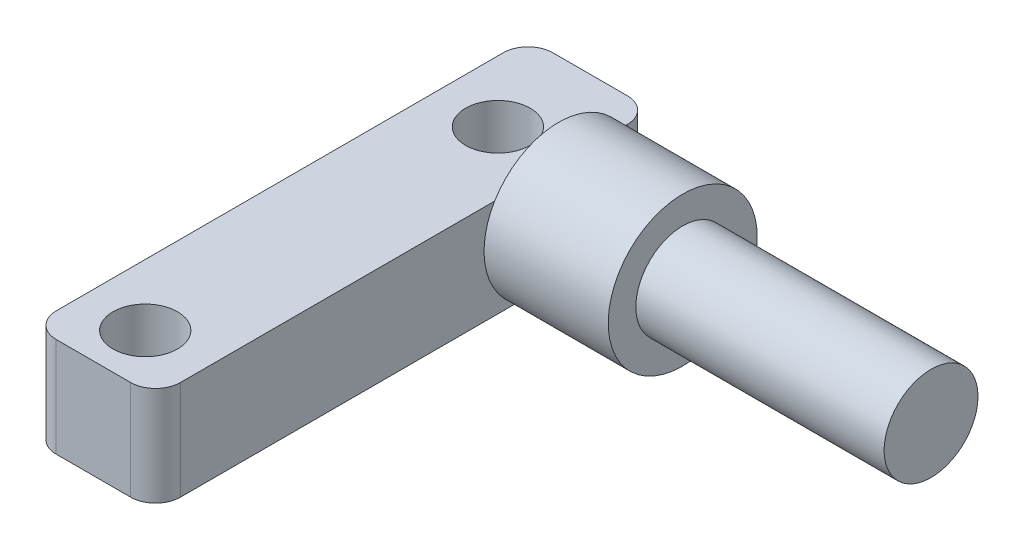
ISO-10303-21;
HEADER;
FILE_DESCRIPTION(('STEP AP214'),'2;1');
FILE_NAME('part.step','',(''),(''),'','','');
FILE_SCHEMA(('AUTOMOTIVE_DESIGN { 1 0 10303 214 1 1 1 1 }'));
ENDSEC;
DATA;
#1=APPLICATION_CONTEXT('core data for automotive mechanical design processes');
#2=APPLICATION_PROTOCOL_DEFINITION('international standard','automotive_design',2000,#1);
#3=PRODUCT_CONTEXT('',#1,'mechanical');
#4=PRODUCT('Part','Part','',(#3));
#5=PRODUCT_RELATED_PRODUCT_CATEGORY('part','',(#4));
#6=PRODUCT_DEFINITION_FORMATION('','',#4);
#7=PRODUCT_DEFINITION_CONTEXT('part definition',#1,'design');
#8=PRODUCT_DEFINITION('design','',#6,#7);
#9=PRODUCT_DEFINITION_SHAPE('','',#8);
#10=(LENGTH_UNIT() NAMED_UNIT(*) SI_UNIT(.MILLI.,.METRE.));
#11=(NAMED_UNIT(*) PLANE_ANGLE_UNIT() SI_UNIT($,.RADIAN.));
#12=(NAMED_UNIT(*) SI_UNIT($,.STERADIAN.) SOLID_ANGLE_UNIT());
#13=UNCERTAINTY_MEASURE_WITH_UNIT(LENGTH_MEASURE(1.E-05),#10,'distance_accuracy_value','');
#14=(GEOMETRIC_REPRESENTATION_CONTEXT(3) GLOBAL_UNCERTAINTY_ASSIGNED_CONTEXT((#13)) GLOBAL_UNIT_ASSIGNED_CONTEXT((#10,
#11,#12)) REPRESENTATION_CONTEXT('',''));
#15=CARTESIAN_POINT('',(0.,0.,0.));
#16=DIRECTION('',(0.,0.,1.));
#17=DIRECTION('',(1.,0.,0.));
#18=AXIS2_PLACEMENT_3D('',#15,#16,#17);
#19=CARTESIAN_POINT('',(2.8272795465911,5.08,7.25290881813636));
#20=DIRECTION('',(1.,0.,0.));
#21=DIRECTION('',(0.,0.,-1.));
#22=AXIS2_PLACEMENT_3D('',#19,#20,#21);
#23=PLANE('',#22);
#24=DIRECTION('',(0.,-1.,0.));
#25=VECTOR('',#24,1.);
#26=CARTESIAN_POINT('',(2.8272795465911,5.08,8.52290881813636));
#27=LINE('',#26,#25);
#28=CARTESIAN_POINT('',(2.8272795465911,0.,8.52290881813636));
#29=VERTEX_POINT('',#28);
#30=CARTESIAN_POINT('',(2.8272795465911,1.66529913308761,8.52290881813636));
#31=VERTEX_POINT('',#30);
#32=EDGE_CURVE('E11',#29,#31,#27,.F.);
#33=ORIENTED_EDGE('',*,*,#32,.T.);
#34=CARTESIAN_POINT('',(2.8272795465911,3.1242,12.0425264480107));
#35=DIRECTION('',(1.,0.,0.));
#36=DIRECTION('',(0.,0.,-1.));
#37=AXIS2_PLACEMENT_3D('',#34,#35,#36);
#38=CIRCLE('',#37,3.81);
#39=CARTESIAN_POINT('',(2.8272795465911,0.,9.86182143357156));
#40=VERTEX_POINT('',#39);
#41=EDGE_CURVE('E158',#40,#31,#38,.T.);
#42=ORIENTED_EDGE('',*,*,#41,.F.);
#43=DIRECTION('',(0.,0.,1.));
#44=VECTOR('',#43,1.);
#45=CARTESIAN_POINT('',(2.8272795465911,0.,7.25290881813636));
#46=LINE('',#45,#44);
#47=EDGE_CURVE('E202',#29,#40,#46,.T.);
#48=ORIENTED_EDGE('',*,*,#47,.F.);
#49=EDGE_LOOP('',(#33,#42,#48));
#50=FACE_BOUND('',#49,.T.);
#51=ADVANCED_FACE('F45',(#50),#23,.T.);
#52=CARTESIAN_POINT('',(2.8272795465911,0.,14.2232314624498));
#53=VERTEX_POINT('',#52);
#54=CARTESIAN_POINT('',(2.8272795465911,0.,31.3829088181364));
#55=VERTEX_POINT('',#54);
#56=EDGE_CURVE('E201',#53,#55,#46,.T.);
#57=ORIENTED_EDGE('',*,*,#56,.F.);
#58=CARTESIAN_POINT('',(2.8272795465911,5.08,15.3122277126525));
#59=VERTEX_POINT('',#58);
#60=EDGE_CURVE('E304',#59,#53,#38,.T.);
#61=ORIENTED_EDGE('',*,*,#60,.F.);
#62=DIRECTION('',(0.,0.,1.));
#63=VECTOR('',#62,1.);
#64=CARTESIAN_POINT('',(2.8272795465911,5.08,7.25290881813636));
#65=LINE('',#64,#63);
#66=CARTESIAN_POINT('',(2.8272795465911,5.08,31.3829088181364));
#67=VERTEX_POINT('',#66);
#68=EDGE_CURVE('E187',#59,#67,#65,.T.);
#69=ORIENTED_EDGE('',*,*,#68,.T.);
#70=DIRECTION('',(0.,-1.,0.));
#71=VECTOR('',#70,1.);
#72=CARTESIAN_POINT('',(2.8272795465911,5.08,31.3829088181364));
#73=LINE('',#72,#71);
#74=EDGE_CURVE('E224',#67,#55,#73,.T.);
#75=ORIENTED_EDGE('',*,*,#74,.T.);
#76=EDGE_LOOP('',(#57,#61,#69,#75));
#77=FACE_BOUND('',#76,.T.);
#78=ADVANCED_FACE('F315',(#77),#23,.T.);
#79=CARTESIAN_POINT('',(-3.5227204534089,5.08,7.25290881813636));
#80=DIRECTION('',(1.,0.,0.));
#81=DIRECTION('',(0.,0.,-1.));
#82=AXIS2_PLACEMENT_3D('',#79,#80,#81);
#83=PLANE('',#82);
#84=DIRECTION('',(0.,0.,1.));
#85=VECTOR('',#84,1.);
#86=CARTESIAN_POINT('',(-3.5227204534089,5.08,7.25290881813636));
#87=LINE('',#86,#85);
#88=CARTESIAN_POINT('',(-3.5227204534089,5.08,8.52290881813636));
#89=VERTEX_POINT('',#88);
#90=CARTESIAN_POINT('',(-3.5227204534089,5.08,31.3829088181364));
#91=VERTEX_POINT('',#90);
#92=EDGE_CURVE('E180',#89,#91,#87,.T.);
#93=ORIENTED_EDGE('',*,*,#92,.F.);
#94=DIRECTION('',(0.,-1.,0.));
#95=VECTOR('',#94,1.);
#96=CARTESIAN_POINT('',(-3.5227204534089,0.,8.52290881813636));
#97=LINE('',#96,#95);
#98=CARTESIAN_POINT('',(-3.5227204534089,0.,8.52290881813636));
#99=VERTEX_POINT('',#98);
#100=EDGE_CURVE('E238',#89,#99,#97,.T.);
#101=ORIENTED_EDGE('',*,*,#100,.T.);
#102=DIRECTION('',(0.,0.,1.));
#103=VECTOR('',#102,1.);
#104=CARTESIAN_POINT('',(-3.5227204534089,0.,7.25290881813636));
#105=LINE('',#104,#103);
#106=CARTESIAN_POINT('',(-3.5227204534089,0.,31.3829088181364));
#107=VERTEX_POINT('',#106);
#108=EDGE_CURVE('E195',#99,#107,#105,.T.);
#109=ORIENTED_EDGE('',*,*,#108,.T.);
#110=DIRECTION('',(0.,-1.,0.));
#111=VECTOR('',#110,1.);
#112=CARTESIAN_POINT('',(-3.5227204534089,5.08,31.3829088181364));
#113=LINE('',#112,#111);
#114=EDGE_CURVE('E216',#107,#91,#113,.F.);
#115=ORIENTED_EDGE('',*,*,#114,.T.);
#116=EDGE_LOOP('',(#93,#101,#109,#115));
#117=FACE_BOUND('',#116,.T.);
#118=ADVANCED_FACE('F279',(#117),#83,.F.);
#119=CARTESIAN_POINT('',(2.8272795465911,5.08,32.6529088181364));
#120=DIRECTION('',(0.,0.,1.));
#121=DIRECTION('',(1.,0.,0.));
#122=AXIS2_PLACEMENT_3D('',#119,#120,#121);
#123=PLANE('',#122);
#124=DIRECTION('',(-1.,0.,0.));
#125=VECTOR('',#124,1.);
#126=CARTESIAN_POINT('',(2.8272795465911,0.,32.6529088181364));
#127=LINE('',#126,#125);
#128=CARTESIAN_POINT('',(1.5572795465911,0.,32.6529088181364));
#129=VERTEX_POINT('',#128);
#130=CARTESIAN_POINT('',(-2.2527204534089,0.,32.6529088181364));
#131=VERTEX_POINT('',#130);
#132=EDGE_CURVE('E198',#129,#131,#127,.T.);
#133=ORIENTED_EDGE('',*,*,#132,.F.);
#134=DIRECTION('',(0.,-1.,0.));
#135=VECTOR('',#134,1.);
#136=CARTESIAN_POINT('',(1.5572795465911,5.08,32.6529088181364));
#137=LINE('',#136,#135);
#138=CARTESIAN_POINT('',(1.5572795465911,5.08,32.6529088181364));
#139=VERTEX_POINT('',#138);
#140=EDGE_CURVE('E231',#129,#139,#137,.F.);
#141=ORIENTED_EDGE('',*,*,#140,.T.);
#142=DIRECTION('',(-1.,0.,0.));
#143=VECTOR('',#142,1.);
#144=CARTESIAN_POINT('',(2.8272795465911,5.08,32.6529088181364));
#145=LINE('',#144,#143);
#146=CARTESIAN_POINT('',(-2.2527204534089,5.08,32.6529088181364));
#147=VERTEX_POINT('',#146);
#148=EDGE_CURVE('E183',#139,#147,#145,.T.);
#149=ORIENTED_EDGE('',*,*,#148,.T.);
#150=DIRECTION('',(0.,-1.,0.));
#151=VECTOR('',#150,1.);
#152=CARTESIAN_POINT('',(-2.2527204534089,0.,32.6529088181364));
#153=LINE('',#152,#151);
#154=EDGE_CURVE('E194',#147,#131,#153,.T.);
#155=ORIENTED_EDGE('',*,*,#154,.T.);
#156=EDGE_LOOP('',(#133,#141,#149,#155));
#157=FACE_BOUND('',#156,.T.);
#158=ADVANCED_FACE('F295',(#157),#123,.T.);
#159=CARTESIAN_POINT('',(2.8272795465911,5.08,8.52290881813636));
#160=VERTEX_POINT('',#159);
#161=CARTESIAN_POINT('',(2.8272795465911,5.08,8.77282518336893));
#162=VERTEX_POINT('',#161);
#163=EDGE_CURVE('E142',#160,#162,#65,.T.);
#164=ORIENTED_EDGE('',*,*,#163,.T.);
#165=CARTESIAN_POINT('',(2.8272795465911,4.58310086691239,8.52290881813636));
#166=VERTEX_POINT('',#165);
#167=EDGE_CURVE('E140',#166,#162,#38,.T.);
#168=ORIENTED_EDGE('',*,*,#167,.F.);
#169=EDGE_CURVE('E57',#166,#160,#27,.F.);
#170=ORIENTED_EDGE('',*,*,#169,.T.);
#171=EDGE_LOOP('',(#164,#168,#170));
#172=FACE_BOUND('',#171,.T.);
#173=ADVANCED_FACE('F141',(#172),#23,.T.);
#174=CARTESIAN_POINT('',(-3.5227204534089,5.08,7.25290881813636));
#175=DIRECTION('',(0.,0.,-1.));
#176=DIRECTION('',(-1.,0.,0.));
#177=AXIS2_PLACEMENT_3D('',#174,#175,#176);
#178=PLANE('',#177);
#179=DIRECTION('',(1.,0.,0.));
#180=VECTOR('',#179,1.);
#181=CARTESIAN_POINT('',(-3.5227204534089,0.,7.25290881813636));
#182=LINE('',#181,#180);
#183=CARTESIAN_POINT('',(-2.2527204534089,0.,7.25290881813636));
#184=VERTEX_POINT('',#183);
#185=CARTESIAN_POINT('',(1.5572795465911,0.,7.25290881813636));
#186=VERTEX_POINT('',#185);
#187=EDGE_CURVE('E184',#184,#186,#182,.T.);
#188=ORIENTED_EDGE('',*,*,#187,.F.);
#189=DIRECTION('',(0.,-1.,0.));
#190=VECTOR('',#189,1.);
#191=CARTESIAN_POINT('',(-2.2527204534089,5.08,7.25290881813636));
#192=LINE('',#191,#190);
#193=CARTESIAN_POINT('',(-2.2527204534089,5.08,7.25290881813636));
#194=VERTEX_POINT('',#193);
#195=EDGE_CURVE('E252',#184,#194,#192,.F.);
#196=ORIENTED_EDGE('',*,*,#195,.T.);
#197=DIRECTION('',(1.,0.,0.));
#198=VECTOR('',#197,1.);
#199=CARTESIAN_POINT('',(-3.5227204534089,5.08,7.25290881813636));
#200=LINE('',#199,#198);
#201=CARTESIAN_POINT('',(1.5572795465911,5.08,7.25290881813636));
#202=VERTEX_POINT('',#201);
#203=EDGE_CURVE('E190',#194,#202,#200,.T.);
#204=ORIENTED_EDGE('',*,*,#203,.T.);
#205=DIRECTION('',(0.,-1.,0.));
#206=VECTOR('',#205,1.);
#207=CARTESIAN_POINT('',(1.5572795465911,5.08,7.25290881813636));
#208=LINE('',#207,#206);
#209=EDGE_CURVE('E248',#202,#186,#208,.T.);
#210=ORIENTED_EDGE('',*,*,#209,.T.);
#211=EDGE_LOOP('',(#188,#196,#204,#210));
#212=FACE_BOUND('',#211,.T.);
#213=ADVANCED_FACE('F288',(#212),#178,.T.);
#214=CARTESIAN_POINT('',(0.,5.08,0.));
#215=DIRECTION('',(0.,-1.,0.));
#216=DIRECTION('',(-1.,0.,0.));
#217=AXIS2_PLACEMENT_3D('',#214,#215,#216);
#218=PLANE('',#217);
#219=CARTESIAN_POINT('',(-0.380999999999998,5.08,11.938));
#220=DIRECTION('',(0.,1.,0.));
#221=DIRECTION('',(0.,0.,1.));
#222=AXIS2_PLACEMENT_3D('',#219,#220,#221);
#223=CIRCLE('',#222,1.651);
#224=CARTESIAN_POINT('',(-0.380999999999998,5.08,13.589));
#225=VERTEX_POINT('',#224);
#226=EDGE_CURVE('E359',#225,#225,#223,.T.);
#227=ORIENTED_EDGE('',*,*,#226,.F.);
#228=EDGE_LOOP('',(#227));
#229=FACE_BOUND('',#228,.T.);
#230=CARTESIAN_POINT('',(-0.381,5.08,29.972));
#231=DIRECTION('',(0.,1.,0.));
#232=DIRECTION('',(0.,0.,1.));
#233=AXIS2_PLACEMENT_3D('',#230,#231,#232);
#234=CIRCLE('',#233,1.651);
#235=CARTESIAN_POINT('',(-0.381,5.08,31.623));
#236=VERTEX_POINT('',#235);
#237=EDGE_CURVE('E175',#236,#236,#234,.T.);
#238=ORIENTED_EDGE('',*,*,#237,.F.);
#239=EDGE_LOOP('',(#238));
#240=FACE_BOUND('',#239,.T.);
#241=ORIENTED_EDGE('',*,*,#203,.F.);
#242=CARTESIAN_POINT('',(-2.2527204534089,5.08,8.52290881813636));
#243=DIRECTION('',(0.,-1.,0.));
#244=DIRECTION('',(0.,0.,-1.));
#245=AXIS2_PLACEMENT_3D('',#242,#243,#244);
#246=CIRCLE('',#245,1.27);
#247=EDGE_CURVE('E138',#194,#89,#246,.F.);
#248=ORIENTED_EDGE('',*,*,#247,.T.);
#249=ORIENTED_EDGE('',*,*,#92,.T.);
#250=CARTESIAN_POINT('',(-2.2527204534089,5.08,31.3829088181364));
#251=DIRECTION('',(0.,-1.,0.));
#252=DIRECTION('',(0.,0.,-1.));
#253=AXIS2_PLACEMENT_3D('',#250,#251,#252);
#254=CIRCLE('',#253,1.27);
#255=EDGE_CURVE('E220',#91,#147,#254,.F.);
#256=ORIENTED_EDGE('',*,*,#255,.T.);
#257=ORIENTED_EDGE('',*,*,#148,.F.);
#258=CARTESIAN_POINT('',(1.5572795465911,5.08,31.3829088181364));
#259=DIRECTION('',(0.,-1.,0.));
#260=DIRECTION('',(0.,0.,-1.));
#261=AXIS2_PLACEMENT_3D('',#258,#259,#260);
#262=CIRCLE('',#261,1.27);
#263=EDGE_CURVE('E234',#139,#67,#262,.F.);
#264=ORIENTED_EDGE('',*,*,#263,.T.);
#265=ORIENTED_EDGE('',*,*,#68,.F.);
#266=DIRECTION('',(0.,0.,1.));
#267=VECTOR('',#266,1.);
#268=CARTESIAN_POINT('',(2.8272795465911,5.08,0.));
#269=LINE('',#268,#267);
#270=EDGE_CURVE('E63',#162,#59,#269,.T.);
#271=ORIENTED_EDGE('',*,*,#270,.F.);
#272=ORIENTED_EDGE('',*,*,#163,.F.);
#273=CARTESIAN_POINT('',(1.5572795465911,5.08,8.52290881813636));
#274=DIRECTION('',(0.,-1.,0.));
#275=DIRECTION('',(0.,0.,-1.));
#276=AXIS2_PLACEMENT_3D('',#273,#274,#275);
#277=CIRCLE('',#276,1.27);
#278=EDGE_CURVE('E135',#160,#202,#277,.F.);
#279=ORIENTED_EDGE('',*,*,#278,.T.);
#280=EDGE_LOOP('',(#241,#248,#249,#256,#257,#264,#265,#271,#272,#279));
#281=FACE_BOUND('',#280,.T.);
#282=ADVANCED_FACE('F270',(#229,#240,#281),#218,.F.);
#283=CARTESIAN_POINT('',(0.,0.,0.));
#284=DIRECTION('',(0.,-1.,0.));
#285=DIRECTION('',(-1.,0.,0.));
#286=AXIS2_PLACEMENT_3D('',#283,#284,#285);
#287=PLANE('',#286);
#288=CARTESIAN_POINT('',(-0.380999999999998,0.,11.938));
#289=DIRECTION('',(0.,-1.,0.));
#290=DIRECTION('',(0.,0.,-1.));
#291=AXIS2_PLACEMENT_3D('',#288,#289,#290);
#292=CIRCLE('',#291,1.651);
#293=CARTESIAN_POINT('',(-0.380999999999998,0.,10.287));
#294=VERTEX_POINT('',#293);
#295=EDGE_CURVE('E49',#294,#294,#292,.T.);
#296=ORIENTED_EDGE('',*,*,#295,.F.);
#297=EDGE_LOOP('',(#296));
#298=FACE_BOUND('',#297,.T.);
#299=CARTESIAN_POINT('',(-0.381,0.,29.972));
#300=DIRECTION('',(0.,-1.,0.));
#301=DIRECTION('',(0.,0.,-1.));
#302=AXIS2_PLACEMENT_3D('',#299,#300,#301);
#303=CIRCLE('',#302,1.651);
#304=CARTESIAN_POINT('',(-0.381,0.,28.321));
#305=VERTEX_POINT('',#304);
#306=EDGE_CURVE('E179',#305,#305,#303,.T.);
#307=ORIENTED_EDGE('',*,*,#306,.F.);
#308=EDGE_LOOP('',(#307));
#309=FACE_BOUND('',#308,.T.);
#310=ORIENTED_EDGE('',*,*,#108,.F.);
#311=CARTESIAN_POINT('',(-2.2527204534089,0.,8.52290881813636));
#312=DIRECTION('',(0.,-1.,0.));
#313=DIRECTION('',(0.,0.,-1.));
#314=AXIS2_PLACEMENT_3D('',#311,#312,#313);
#315=CIRCLE('',#314,1.27);
#316=EDGE_CURVE('E245',#99,#184,#315,.T.);
#317=ORIENTED_EDGE('',*,*,#316,.T.);
#318=ORIENTED_EDGE('',*,*,#187,.T.);
#319=CARTESIAN_POINT('',(1.5572795465911,0.,8.52290881813636));
#320=DIRECTION('',(0.,-1.,0.));
#321=DIRECTION('',(0.,0.,-1.));
#322=AXIS2_PLACEMENT_3D('',#319,#320,#321);
#323=CIRCLE('',#322,1.27);
#324=EDGE_CURVE('E242',#186,#29,#323,.T.);
#325=ORIENTED_EDGE('',*,*,#324,.T.);
#326=ORIENTED_EDGE('',*,*,#47,.T.);
#327=DIRECTION('',(0.,0.,1.));
#328=VECTOR('',#327,1.);
#329=CARTESIAN_POINT('',(2.8272795465911,0.,0.));
#330=LINE('',#329,#328);
#331=EDGE_CURVE('E169',#40,#53,#330,.T.);
#332=ORIENTED_EDGE('',*,*,#331,.T.);
#333=ORIENTED_EDGE('',*,*,#56,.T.);
#334=CARTESIAN_POINT('',(1.5572795465911,0.,31.3829088181364));
#335=DIRECTION('',(0.,-1.,0.));
#336=DIRECTION('',(0.,0.,-1.));
#337=AXIS2_PLACEMENT_3D('',#334,#335,#336);
#338=CIRCLE('',#337,1.27);
#339=EDGE_CURVE('E228',#55,#129,#338,.T.);
#340=ORIENTED_EDGE('',*,*,#339,.T.);
#341=ORIENTED_EDGE('',*,*,#132,.T.);
#342=CARTESIAN_POINT('',(-2.2527204534089,0.,31.3829088181364));
#343=DIRECTION('',(0.,-1.,0.));
#344=DIRECTION('',(0.,0.,-1.));
#345=AXIS2_PLACEMENT_3D('',#342,#343,#344);
#346=CIRCLE('',#345,1.27);
#347=EDGE_CURVE('E212',#131,#107,#346,.T.);
#348=ORIENTED_EDGE('',*,*,#347,.T.);
#349=EDGE_LOOP('',(#310,#317,#318,#325,#326,#332,#333,#340,#341,#348));
#350=FACE_BOUND('',#349,.T.);
#351=ADVANCED_FACE('F266',(#298,#309,#350),#287,.T.);
#352=CARTESIAN_POINT('',(-2.2527204534089,5.08,31.3829088181364));
#353=DIRECTION('',(0.,1.,0.));
#354=DIRECTION('',(0.,0.,1.));
#355=AXIS2_PLACEMENT_3D('',#352,#353,#354);
#356=CYLINDRICAL_SURFACE('',#355,1.27);
#357=ORIENTED_EDGE('',*,*,#255,.F.);
#358=ORIENTED_EDGE('',*,*,#114,.F.);
#359=ORIENTED_EDGE('',*,*,#347,.F.);
#360=ORIENTED_EDGE('',*,*,#154,.F.);
#361=EDGE_LOOP('',(#357,#358,#359,#360));
#362=FACE_BOUND('',#361,.T.);
#363=ADVANCED_FACE('F269',(#362),#356,.T.);
#364=CARTESIAN_POINT('',(1.5572795465911,5.08,31.3829088181364));
#365=DIRECTION('',(0.,-1.,0.));
#366=DIRECTION('',(0.,0.,-1.));
#367=AXIS2_PLACEMENT_3D('',#364,#365,#366);
#368=CYLINDRICAL_SURFACE('',#367,1.27);
#369=ORIENTED_EDGE('',*,*,#263,.F.);
#370=ORIENTED_EDGE('',*,*,#140,.F.);
#371=ORIENTED_EDGE('',*,*,#339,.F.);
#372=ORIENTED_EDGE('',*,*,#74,.F.);
#373=EDGE_LOOP('',(#369,#370,#371,#372));
#374=FACE_BOUND('',#373,.T.);
#375=ADVANCED_FACE('F299',(#374),#368,.T.);
#376=CARTESIAN_POINT('',(-2.2527204534089,5.08,8.52290881813636));
#377=DIRECTION('',(0.,1.,0.));
#378=DIRECTION('',(0.,0.,1.));
#379=AXIS2_PLACEMENT_3D('',#376,#377,#378);
#380=CYLINDRICAL_SURFACE('',#379,1.27);
#381=ORIENTED_EDGE('',*,*,#247,.F.);
#382=ORIENTED_EDGE('',*,*,#195,.F.);
#383=ORIENTED_EDGE('',*,*,#316,.F.);
#384=ORIENTED_EDGE('',*,*,#100,.F.);
#385=EDGE_LOOP('',(#381,#382,#383,#384));
#386=FACE_BOUND('',#385,.T.);
#387=ADVANCED_FACE('F284',(#386),#380,.T.);
#388=CARTESIAN_POINT('',(1.5572795465911,5.08,8.52290881813636));
#389=DIRECTION('',(0.,-1.,0.));
#390=DIRECTION('',(0.,0.,-1.));
#391=AXIS2_PLACEMENT_3D('',#388,#389,#390);
#392=CYLINDRICAL_SURFACE('',#391,1.27);
#393=ORIENTED_EDGE('',*,*,#278,.F.);
#394=ORIENTED_EDGE('',*,*,#169,.F.);
#395=EDGE_CURVE('E55',#31,#166,#27,.F.);
#396=ORIENTED_EDGE('',*,*,#395,.F.);
#397=ORIENTED_EDGE('',*,*,#32,.F.);
#398=ORIENTED_EDGE('',*,*,#324,.F.);
#399=ORIENTED_EDGE('',*,*,#209,.F.);
#400=EDGE_LOOP('',(#393,#394,#396,#397,#398,#399));
#401=FACE_BOUND('',#400,.T.);
#402=ADVANCED_FACE('F47',(#401),#392,.T.);
#403=CARTESIAN_POINT('',(-0.381,-1.27,29.972));
#404=DIRECTION('',(0.,1.,0.));
#405=DIRECTION('',(0.,0.,1.));
#406=AXIS2_PLACEMENT_3D('',#403,#404,#405);
#407=CYLINDRICAL_SURFACE('',#406,1.651);
#408=ORIENTED_EDGE('',*,*,#306,.T.);
#409=EDGE_LOOP('',(#408));
#410=FACE_BOUND('',#409,.T.);
#411=ORIENTED_EDGE('',*,*,#237,.T.);
#412=EDGE_LOOP('',(#411));
#413=FACE_BOUND('',#412,.T.);
#414=ADVANCED_FACE('F263',(#410,#413),#407,.F.);
#415=CARTESIAN_POINT('',(2.8272795465911,3.1242,12.0425264480107));
#416=DIRECTION('',(1.,0.,0.));
#417=DIRECTION('',(0.,0.,-1.));
#418=AXIS2_PLACEMENT_3D('',#415,#416,#417);
#419=PLANE('',#418);
#420=ORIENTED_EDGE('',*,*,#270,.T.);
#421=EDGE_CURVE('E148',#162,#59,#38,.T.);
#422=ORIENTED_EDGE('',*,*,#421,.F.);
#423=EDGE_LOOP('',(#420,#422));
#424=FACE_BOUND('',#423,.T.);
#425=ADVANCED_FACE('F343',(#424),#419,.F.);
#426=EDGE_CURVE('E150',#31,#166,#38,.T.);
#427=ORIENTED_EDGE('',*,*,#426,.F.);
#428=ORIENTED_EDGE('',*,*,#395,.T.);
#429=EDGE_LOOP('',(#427,#428));
#430=FACE_BOUND('',#429,.T.);
#431=ADVANCED_FACE('F153',(#430),#419,.F.);
#432=CARTESIAN_POINT('',(9.1772795465911,3.1242,12.0425264480107));
#433=DIRECTION('',(-1.,0.,0.));
#434=DIRECTION('',(0.,0.,1.));
#435=AXIS2_PLACEMENT_3D('',#432,#433,#434);
#436=CYLINDRICAL_SURFACE('',#435,3.81);
#437=CARTESIAN_POINT('',(9.1772795465911,3.1242,12.0425264480107));
#438=DIRECTION('',(1.,0.,0.));
#439=DIRECTION('',(0.,0.,-1.));
#440=AXIS2_PLACEMENT_3D('',#437,#438,#439);
#441=CIRCLE('',#440,3.81);
#442=CARTESIAN_POINT('',(9.1772795465911,3.1242,8.2325264480107));
#443=VERTEX_POINT('',#442);
#444=EDGE_CURVE('E147',#443,#443,#441,.T.);
#445=ORIENTED_EDGE('',*,*,#444,.F.);
#446=EDGE_LOOP('',(#445));
#447=FACE_BOUND('',#446,.T.);
#448=ORIENTED_EDGE('',*,*,#167,.T.);
#449=ORIENTED_EDGE('',*,*,#421,.T.);
#450=ORIENTED_EDGE('',*,*,#60,.T.);
#451=EDGE_CURVE('E163',#53,#40,#38,.T.);
#452=ORIENTED_EDGE('',*,*,#451,.T.);
#453=ORIENTED_EDGE('',*,*,#41,.T.);
#454=ORIENTED_EDGE('',*,*,#426,.T.);
#455=EDGE_LOOP('',(#448,#449,#450,#452,#453,#454));
#456=FACE_BOUND('',#455,.T.);
#457=ADVANCED_FACE('F156',(#447,#456),#436,.T.);
#458=CARTESIAN_POINT('',(9.1772795465911,3.1242,12.0425264480107));
#459=DIRECTION('',(1.,0.,0.));
#460=DIRECTION('',(0.,0.,-1.));
#461=AXIS2_PLACEMENT_3D('',#458,#459,#460);
#462=PLANE('',#461);
#463=CARTESIAN_POINT('',(9.1772795465911,3.1242,12.0425264480107));
#464=DIRECTION('',(1.,0.,0.));
#465=DIRECTION('',(0.,0.,-1.));
#466=AXIS2_PLACEMENT_3D('',#463,#464,#465);
#467=CIRCLE('',#466,2.3999952);
#468=CARTESIAN_POINT('',(9.1772795465911,3.1242,9.6425312480107));
#469=VERTEX_POINT('',#468);
#470=EDGE_CURVE('E160',#469,#469,#467,.F.);
#471=ORIENTED_EDGE('',*,*,#470,.T.);
#472=EDGE_LOOP('',(#471));
#473=FACE_BOUND('',#472,.T.);
#474=ORIENTED_EDGE('',*,*,#444,.T.);
#475=EDGE_LOOP('',(#474));
#476=FACE_BOUND('',#475,.T.);
#477=ADVANCED_FACE('F382',(#473,#476),#462,.T.);
#478=ORIENTED_EDGE('',*,*,#331,.F.);
#479=ORIENTED_EDGE('',*,*,#451,.F.);
#480=EDGE_LOOP('',(#478,#479));
#481=FACE_BOUND('',#480,.T.);
#482=ADVANCED_FACE('F311',(#481),#419,.F.);
#483=CARTESIAN_POINT('',(21.8772795465911,3.1242,12.0425264480107));
#484=DIRECTION('',(-1.,0.,0.));
#485=DIRECTION('',(0.,0.,1.));
#486=AXIS2_PLACEMENT_3D('',#483,#484,#485);
#487=CYLINDRICAL_SURFACE('',#486,2.3999952);
#488=ORIENTED_EDGE('',*,*,#470,.F.);
#489=EDGE_LOOP('',(#488));
#490=FACE_BOUND('',#489,.T.);
#491=CARTESIAN_POINT('',(21.8772795465911,3.1242,12.0425264480107));
#492=DIRECTION('',(1.,0.,0.));
#493=DIRECTION('',(0.,0.,-1.));
#494=AXIS2_PLACEMENT_3D('',#491,#492,#493);
#495=CIRCLE('',#494,2.3999952);
#496=CARTESIAN_POINT('',(21.8772795465911,3.1242,9.6425312480107));
#497=VERTEX_POINT('',#496);
#498=EDGE_CURVE('E165',#497,#497,#495,.T.);
#499=ORIENTED_EDGE('',*,*,#498,.F.);
#500=EDGE_LOOP('',(#499));
#501=FACE_BOUND('',#500,.T.);
#502=ADVANCED_FACE('F372',(#490,#501),#487,.T.);
#503=CARTESIAN_POINT('',(21.8772795465911,3.1242,12.0425264480107));
#504=DIRECTION('',(1.,0.,0.));
#505=DIRECTION('',(0.,0.,-1.));
#506=AXIS2_PLACEMENT_3D('',#503,#504,#505);
#507=PLANE('',#506);
#508=ORIENTED_EDGE('',*,*,#498,.T.);
#509=EDGE_LOOP('',(#508));
#510=FACE_BOUND('',#509,.T.);
#511=ADVANCED_FACE('F370',(#510),#507,.T.);
#512=CARTESIAN_POINT('',(-0.380999999999998,-1.27,11.938));
#513=DIRECTION('',(0.,1.,0.));
#514=DIRECTION('',(0.,0.,1.));
#515=AXIS2_PLACEMENT_3D('',#512,#513,#514);
#516=CYLINDRICAL_SURFACE('',#515,1.651);
#517=ORIENTED_EDGE('',*,*,#295,.T.);
#518=EDGE_LOOP('',(#517));
#519=FACE_BOUND('',#518,.T.);
#520=ORIENTED_EDGE('',*,*,#226,.T.);
#521=EDGE_LOOP('',(#520));
#522=FACE_BOUND('',#521,.T.);
#523=ADVANCED_FACE('F379',(#519,#522),#516,.F.);
#524=CLOSED_SHELL('',(#51,#78,#118,#158,#173,#213,#282,#351,#363,#375,#387,#402,#414,#425,#431,
#457,#477,#482,#502,#511,#523));
#525=MANIFOLD_SOLID_BREP('B2',#524);
#526=ADVANCED_BREP_SHAPE_REPRESENTATION('',(#18,#525),#14);
#527=SHAPE_DEFINITION_REPRESENTATION(#9,#526);
ENDSEC;
END-ISO-10303-21;
